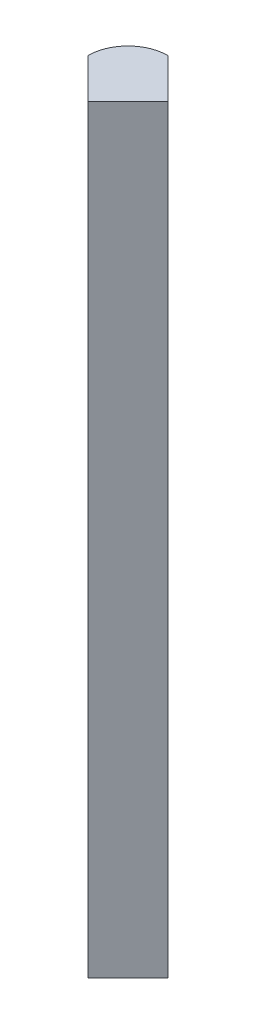
ISO-10303-21;
HEADER;
FILE_DESCRIPTION(('STEP AP214'),'2;1');
FILE_NAME('part.step','',(''),(''),'','','');
FILE_SCHEMA(('AUTOMOTIVE_DESIGN { 1 0 10303 214 1 1 1 1 }'));
ENDSEC;
DATA;
#1=APPLICATION_CONTEXT('core data for automotive mechanical design processes');
#2=APPLICATION_PROTOCOL_DEFINITION('international standard','automotive_design',2000,#1);
#3=PRODUCT_CONTEXT('',#1,'mechanical');
#4=PRODUCT('Part','Part','',(#3));
#5=PRODUCT_RELATED_PRODUCT_CATEGORY('part','',(#4));
#6=PRODUCT_DEFINITION_FORMATION('','',#4);
#7=PRODUCT_DEFINITION_CONTEXT('part definition',#1,'design');
#8=PRODUCT_DEFINITION('design','',#6,#7);
#9=PRODUCT_DEFINITION_SHAPE('','',#8);
#10=(LENGTH_UNIT() NAMED_UNIT(*) SI_UNIT(.MILLI.,.METRE.));
#11=(NAMED_UNIT(*) PLANE_ANGLE_UNIT() SI_UNIT($,.RADIAN.));
#12=(NAMED_UNIT(*) SI_UNIT($,.STERADIAN.) SOLID_ANGLE_UNIT());
#13=UNCERTAINTY_MEASURE_WITH_UNIT(LENGTH_MEASURE(1.E-05),#10,'distance_accuracy_value','');
#14=(GEOMETRIC_REPRESENTATION_CONTEXT(3) GLOBAL_UNCERTAINTY_ASSIGNED_CONTEXT((#13)) GLOBAL_UNIT_ASSIGNED_CONTEXT((#10,
#11,#12)) REPRESENTATION_CONTEXT('',''));
#15=CARTESIAN_POINT('',(0.,0.,0.));
#16=DIRECTION('',(0.,0.,1.));
#17=DIRECTION('',(1.,0.,0.));
#18=AXIS2_PLACEMENT_3D('',#15,#16,#17);
#19=CARTESIAN_POINT('',(0.,76.2,0.));
#20=DIRECTION('',(0.,-1.,0.));
#21=DIRECTION('',(0.,0.,-1.));
#22=AXIS2_PLACEMENT_3D('',#19,#20,#21);
#23=CYLINDRICAL_SURFACE('',#22,4.);
#24=CARTESIAN_POINT('',(0.,0.,0.));
#25=DIRECTION('',(0.,1.,0.));
#26=DIRECTION('',(0.,0.,-1.));
#27=AXIS2_PLACEMENT_3D('',#24,#25,#26);
#28=CIRCLE('',#27,4.);
#29=CARTESIAN_POINT('',(0.00445123972434471,0.,-3.99999752330735));
#30=VERTEX_POINT('',#29);
#31=CARTESIAN_POINT('',(-3.99999752330735,0.,-0.00445123972434471));
#32=VERTEX_POINT('',#31);
#33=EDGE_CURVE('E100',#30,#32,#28,.T.);
#34=ORIENTED_EDGE('',*,*,#33,.T.);
#35=DIRECTION('',(0.,-1.,0.));
#36=VECTOR('',#35,1.);
#37=CARTESIAN_POINT('',(-3.99999752330735,76.2,-0.00445123972434471));
#38=LINE('',#37,#36);
#39=CARTESIAN_POINT('',(-3.99999752330735,76.2,-0.00445123972434471));
#40=VERTEX_POINT('',#39);
#41=EDGE_CURVE('E11',#40,#32,#38,.T.);
#42=ORIENTED_EDGE('',*,*,#41,.F.);
#43=CARTESIAN_POINT('',(0.,76.2,0.));
#44=DIRECTION('',(0.,1.,0.));
#45=DIRECTION('',(0.,0.,-1.));
#46=AXIS2_PLACEMENT_3D('',#43,#44,#45);
#47=CIRCLE('',#46,4.);
#48=CARTESIAN_POINT('',(0.00445123972434471,76.2,-3.99999752330735));
#49=VERTEX_POINT('',#48);
#50=EDGE_CURVE('E88',#49,#40,#47,.T.);
#51=ORIENTED_EDGE('',*,*,#50,.F.);
#52=DIRECTION('',(0.,-1.,0.));
#53=VECTOR('',#52,1.);
#54=CARTESIAN_POINT('',(0.00445123972434471,76.2,-3.99999752330735));
#55=LINE('',#54,#53);
#56=EDGE_CURVE('E96',#49,#30,#55,.T.);
#57=ORIENTED_EDGE('',*,*,#56,.T.);
#58=EDGE_LOOP('',(#34,#42,#51,#57));
#59=FACE_BOUND('',#58,.T.);
#60=ADVANCED_FACE('F37',(#59),#23,.T.);
#61=CARTESIAN_POINT('',(-3.99999752330735,76.2,-0.00445123972434471));
#62=DIRECTION('',(0.707106781186548,0.,-0.707106781186548));
#63=DIRECTION('',(-0.707106781186548,0.,-0.707106781186548));
#64=AXIS2_PLACEMENT_3D('',#61,#62,#63);
#65=PLANE('',#64);
#66=DIRECTION('',(0.707106781186548,0.,0.707106781186548));
#67=VECTOR('',#66,1.);
#68=CARTESIAN_POINT('',(-3.99999752330735,0.,-0.00445123972434471));
#69=LINE('',#68,#67);
#70=CARTESIAN_POINT('',(2.47705158901851E-06,0.,3.9955487606346));
#71=VERTEX_POINT('',#70);
#72=EDGE_CURVE('E92',#32,#71,#69,.T.);
#73=ORIENTED_EDGE('',*,*,#72,.T.);
#74=DIRECTION('',(0.,-1.,0.));
#75=VECTOR('',#74,1.);
#76=CARTESIAN_POINT('',(2.47705158901851E-06,76.2,3.9955487606346));
#77=LINE('',#76,#75);
#78=CARTESIAN_POINT('',(2.47705158901851E-06,76.2,3.9955487606346));
#79=VERTEX_POINT('',#78);
#80=EDGE_CURVE('E45',#79,#71,#77,.T.);
#81=ORIENTED_EDGE('',*,*,#80,.F.);
#82=DIRECTION('',(0.707106781186548,0.,0.707106781186548));
#83=VECTOR('',#82,1.);
#84=CARTESIAN_POINT('',(-3.99999752330735,76.2,-0.00445123972434471));
#85=LINE('',#84,#83);
#86=EDGE_CURVE('E83',#40,#79,#85,.T.);
#87=ORIENTED_EDGE('',*,*,#86,.F.);
#88=ORIENTED_EDGE('',*,*,#41,.T.);
#89=EDGE_LOOP('',(#73,#81,#87,#88));
#90=FACE_BOUND('',#89,.T.);
#91=ADVANCED_FACE('F91',(#90),#65,.F.);
#92=CARTESIAN_POINT('',(2.47705158901851E-06,76.2,3.9955487606346));
#93=DIRECTION('',(-0.707106781186548,0.,-0.707106781186547));
#94=DIRECTION('',(-0.707106781186547,0.,0.707106781186548));
#95=AXIS2_PLACEMENT_3D('',#92,#93,#94);
#96=PLANE('',#95);
#97=DIRECTION('',(0.707106781186547,0.,-0.707106781186548));
#98=VECTOR('',#97,1.);
#99=CARTESIAN_POINT('',(2.47705158901851E-06,0.,3.9955487606346));
#100=LINE('',#99,#98);
#101=CARTESIAN_POINT('',(4.00000000035894,0.,-0.00444876267275719));
#102=VERTEX_POINT('',#101);
#103=EDGE_CURVE('E70',#71,#102,#100,.T.);
#104=ORIENTED_EDGE('',*,*,#103,.T.);
#105=DIRECTION('',(0.,-1.,0.));
#106=VECTOR('',#105,1.);
#107=CARTESIAN_POINT('',(4.00000000035894,76.2,-0.00444876267275719));
#108=LINE('',#107,#106);
#109=CARTESIAN_POINT('',(4.00000000035894,76.2,-0.00444876267275719));
#110=VERTEX_POINT('',#109);
#111=EDGE_CURVE('E93',#110,#102,#108,.T.);
#112=ORIENTED_EDGE('',*,*,#111,.F.);
#113=DIRECTION('',(0.707106781186547,0.,-0.707106781186548));
#114=VECTOR('',#113,1.);
#115=CARTESIAN_POINT('',(2.47705158901851E-06,76.2,3.9955487606346));
#116=LINE('',#115,#114);
#117=EDGE_CURVE('E86',#79,#110,#116,.T.);
#118=ORIENTED_EDGE('',*,*,#117,.F.);
#119=ORIENTED_EDGE('',*,*,#80,.T.);
#120=EDGE_LOOP('',(#104,#112,#118,#119));
#121=FACE_BOUND('',#120,.T.);
#122=ADVANCED_FACE('F94',(#121),#96,.F.);
#123=CARTESIAN_POINT('',(0.00445123972434471,76.2,-3.99999752330735));
#124=DIRECTION('',(-0.707106781186547,0.,0.707106781186548));
#125=DIRECTION('',(0.707106781186548,0.,0.707106781186547));
#126=AXIS2_PLACEMENT_3D('',#123,#124,#125);
#127=PLANE('',#126);
#128=DIRECTION('',(-0.707106781186548,0.,-0.707106781186547));
#129=VECTOR('',#128,1.);
#130=CARTESIAN_POINT('',(0.00445123972434471,0.,-3.99999752330735));
#131=LINE('',#130,#129);
#132=EDGE_CURVE('E76',#102,#30,#131,.T.);
#133=ORIENTED_EDGE('',*,*,#132,.T.);
#134=ORIENTED_EDGE('',*,*,#56,.F.);
#135=DIRECTION('',(-0.707106781186548,0.,-0.707106781186547));
#136=VECTOR('',#135,1.);
#137=CARTESIAN_POINT('',(0.00445123972434471,76.2,-3.99999752330735));
#138=LINE('',#137,#136);
#139=EDGE_CURVE('E53',#110,#49,#138,.T.);
#140=ORIENTED_EDGE('',*,*,#139,.F.);
#141=ORIENTED_EDGE('',*,*,#111,.T.);
#142=EDGE_LOOP('',(#133,#134,#140,#141));
#143=FACE_BOUND('',#142,.T.);
#144=ADVANCED_FACE('F107',(#143),#127,.F.);
#145=CARTESIAN_POINT('',(0.,76.2,0.));
#146=DIRECTION('',(0.,-1.,0.));
#147=DIRECTION('',(0.,0.,-1.));
#148=AXIS2_PLACEMENT_3D('',#145,#146,#147);
#149=PLANE('',#148);
#150=ORIENTED_EDGE('',*,*,#50,.T.);
#151=ORIENTED_EDGE('',*,*,#86,.T.);
#152=ORIENTED_EDGE('',*,*,#117,.T.);
#153=ORIENTED_EDGE('',*,*,#139,.T.);
#154=EDGE_LOOP('',(#150,#151,#152,#153));
#155=FACE_BOUND('',#154,.T.);
#156=ADVANCED_FACE('F84',(#155),#149,.F.);
#157=CARTESIAN_POINT('',(0.,0.,0.));
#158=DIRECTION('',(0.,-1.,0.));
#159=DIRECTION('',(0.,0.,-1.));
#160=AXIS2_PLACEMENT_3D('',#157,#158,#159);
#161=PLANE('',#160);
#162=ORIENTED_EDGE('',*,*,#33,.F.);
#163=ORIENTED_EDGE('',*,*,#132,.F.);
#164=ORIENTED_EDGE('',*,*,#103,.F.);
#165=ORIENTED_EDGE('',*,*,#72,.F.);
#166=EDGE_LOOP('',(#162,#163,#164,#165));
#167=FACE_BOUND('',#166,.T.);
#168=ADVANCED_FACE('F110',(#167),#161,.T.);
#169=CLOSED_SHELL('',(#60,#91,#122,#144,#156,#168));
#170=MANIFOLD_SOLID_BREP('B2',#169);
#171=ADVANCED_BREP_SHAPE_REPRESENTATION('',(#18,#170),#14);
#172=SHAPE_DEFINITION_REPRESENTATION(#9,#171);
ENDSEC;
END-ISO-10303-21;
